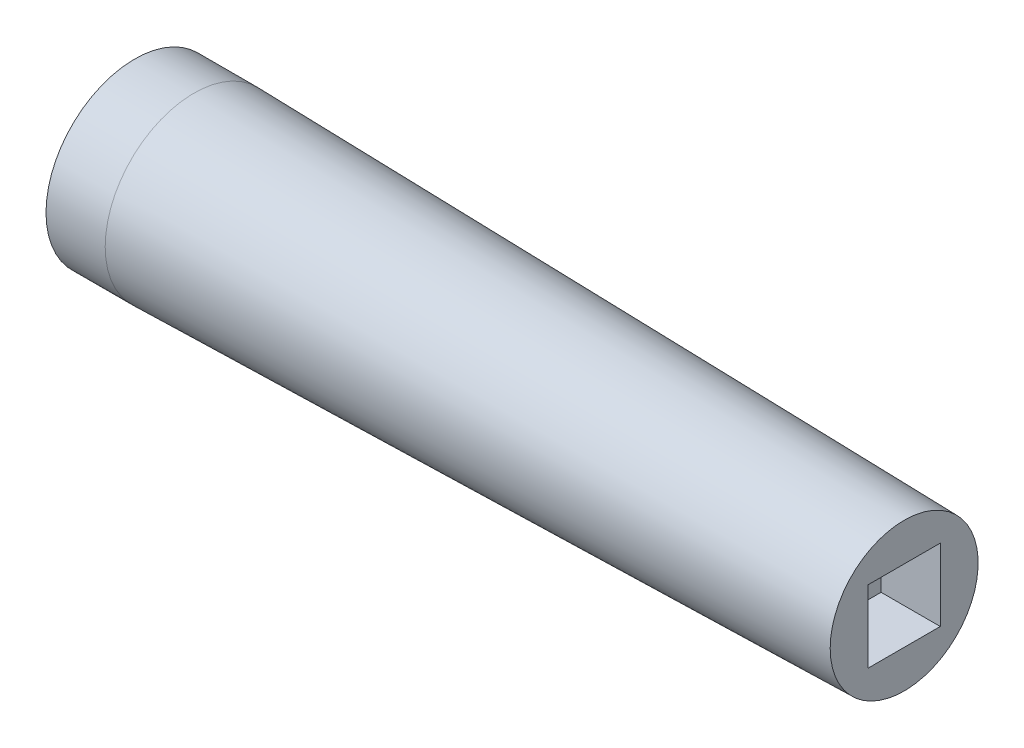
ISO-10303-21;
HEADER;
FILE_DESCRIPTION(('STEP AP214'),'2;1');
FILE_NAME('part.step','',(''),(''),'','','');
FILE_SCHEMA(('AUTOMOTIVE_DESIGN { 1 0 10303 214 1 1 1 1 }'));
ENDSEC;
DATA;
#1=APPLICATION_CONTEXT('core data for automotive mechanical design processes');
#2=APPLICATION_PROTOCOL_DEFINITION('international standard','automotive_design',2000,#1);
#3=PRODUCT_CONTEXT('',#1,'mechanical');
#4=PRODUCT('Part','Part','',(#3));
#5=PRODUCT_RELATED_PRODUCT_CATEGORY('part','',(#4));
#6=PRODUCT_DEFINITION_FORMATION('','',#4);
#7=PRODUCT_DEFINITION_CONTEXT('part definition',#1,'design');
#8=PRODUCT_DEFINITION('design','',#6,#7);
#9=PRODUCT_DEFINITION_SHAPE('','',#8);
#10=(LENGTH_UNIT() NAMED_UNIT(*) SI_UNIT(.MILLI.,.METRE.));
#11=(NAMED_UNIT(*) PLANE_ANGLE_UNIT() SI_UNIT($,.RADIAN.));
#12=(NAMED_UNIT(*) SI_UNIT($,.STERADIAN.) SOLID_ANGLE_UNIT());
#13=UNCERTAINTY_MEASURE_WITH_UNIT(LENGTH_MEASURE(1.E-05),#10,'distance_accuracy_value','');
#14=(GEOMETRIC_REPRESENTATION_CONTEXT(3) GLOBAL_UNCERTAINTY_ASSIGNED_CONTEXT((#13)) GLOBAL_UNIT_ASSIGNED_CONTEXT((#10,
#11,#12)) REPRESENTATION_CONTEXT('',''));
#15=CARTESIAN_POINT('',(0.,0.,0.));
#16=DIRECTION('',(0.,0.,1.));
#17=DIRECTION('',(1.,0.,0.));
#18=AXIS2_PLACEMENT_3D('',#15,#16,#17);
#19=CARTESIAN_POINT('',(0.,0.,0.));
#20=DIRECTION('',(1.,0.,0.));
#21=DIRECTION('',(0.,0.,-1.));
#22=AXIS2_PLACEMENT_3D('',#19,#20,#21);
#23=PLANE('',#22);
#24=CARTESIAN_POINT('',(0.,0.,0.));
#25=DIRECTION('',(-1.,0.,0.));
#26=DIRECTION('',(0.,0.,1.));
#27=AXIS2_PLACEMENT_3D('',#24,#25,#26);
#28=CIRCLE('',#27,19.05);
#29=CARTESIAN_POINT('',(0.,0.,19.05));
#30=VERTEX_POINT('',#29);
#31=EDGE_CURVE('E11',#30,#30,#28,.T.);
#32=ORIENTED_EDGE('',*,*,#31,.T.);
#33=EDGE_LOOP('',(#32));
#34=FACE_BOUND('',#33,.T.);
#35=ADVANCED_FACE('F34',(#34),#23,.F.);
#36=CARTESIAN_POINT('',(-5.7379004897005,0.,0.));
#37=DIRECTION('',(-1.,0.,0.));
#38=DIRECTION('',(0.,0.,1.));
#39=AXIS2_PLACEMENT_3D('',#36,#37,#38);
#40=CYLINDRICAL_SURFACE('',#39,19.05);
#41=ORIENTED_EDGE('',*,*,#31,.F.);
#42=EDGE_LOOP('',(#41));
#43=FACE_BOUND('',#42,.T.);
#44=CARTESIAN_POINT('',(12.7,0.,0.));
#45=DIRECTION('',(-1.,0.,0.));
#46=DIRECTION('',(0.,0.,1.));
#47=AXIS2_PLACEMENT_3D('',#44,#45,#46);
#48=CIRCLE('',#47,19.05);
#49=CARTESIAN_POINT('',(12.7,0.,19.05));
#50=VERTEX_POINT('',#49);
#51=EDGE_CURVE('E41',#50,#50,#48,.T.);
#52=ORIENTED_EDGE('',*,*,#51,.T.);
#53=EDGE_LOOP('',(#52));
#54=FACE_BOUND('',#53,.T.);
#55=ADVANCED_FACE('F116',(#43,#54),#40,.T.);
#56=CARTESIAN_POINT('',(165.1,0.,0.));
#57=DIRECTION('',(-1.,0.,0.));
#58=DIRECTION('',(0.,0.,1.));
#59=AXIS2_PLACEMENT_3D('',#56,#57,#58);
#60=CONICAL_SURFACE('',#59,15.875,0.0208303200362171);
#61=ORIENTED_EDGE('',*,*,#51,.F.);
#62=EDGE_LOOP('',(#61));
#63=FACE_BOUND('',#62,.T.);
#64=CARTESIAN_POINT('',(165.1,0.,0.));
#65=DIRECTION('',(-1.,0.,0.));
#66=DIRECTION('',(0.,0.,1.));
#67=AXIS2_PLACEMENT_3D('',#64,#65,#66);
#68=CIRCLE('',#67,15.875);
#69=CARTESIAN_POINT('',(165.1,0.,15.875));
#70=VERTEX_POINT('',#69);
#71=EDGE_CURVE('E109',#70,#70,#68,.T.);
#72=ORIENTED_EDGE('',*,*,#71,.T.);
#73=EDGE_LOOP('',(#72));
#74=FACE_BOUND('',#73,.T.);
#75=ADVANCED_FACE('F118',(#63,#74),#60,.T.);
#76=CARTESIAN_POINT('',(165.1,15.875,0.));
#77=DIRECTION('',(-1.,0.,0.));
#78=DIRECTION('',(0.,0.,1.));
#79=AXIS2_PLACEMENT_3D('',#76,#77,#78);
#80=PLANE('',#79);
#81=DIRECTION('',(0.,0.,-1.));
#82=VECTOR('',#81,1.);
#83=CARTESIAN_POINT('',(165.1,-7.747,-7.747));
#84=LINE('',#83,#82);
#85=CARTESIAN_POINT('',(165.1,-7.747,7.747));
#86=VERTEX_POINT('',#85);
#87=CARTESIAN_POINT('',(165.1,-7.747,-7.747));
#88=VERTEX_POINT('',#87);
#89=EDGE_CURVE('E83',#86,#88,#84,.T.);
#90=ORIENTED_EDGE('',*,*,#89,.F.);
#91=DIRECTION('',(0.,-1.,0.));
#92=VECTOR('',#91,1.);
#93=CARTESIAN_POINT('',(165.1,-7.747,7.747));
#94=LINE('',#93,#92);
#95=CARTESIAN_POINT('',(165.1,7.747,7.747));
#96=VERTEX_POINT('',#95);
#97=EDGE_CURVE('E48',#96,#86,#94,.T.);
#98=ORIENTED_EDGE('',*,*,#97,.F.);
#99=DIRECTION('',(0.,0.,1.));
#100=VECTOR('',#99,1.);
#101=CARTESIAN_POINT('',(165.1,7.747,-7.747));
#102=LINE('',#101,#100);
#103=CARTESIAN_POINT('',(165.1,7.747,-7.747));
#104=VERTEX_POINT('',#103);
#105=EDGE_CURVE('E99',#104,#96,#102,.T.);
#106=ORIENTED_EDGE('',*,*,#105,.F.);
#107=DIRECTION('',(0.,1.,0.));
#108=VECTOR('',#107,1.);
#109=CARTESIAN_POINT('',(165.1,-7.747,-7.747));
#110=LINE('',#109,#108);
#111=EDGE_CURVE('E105',#88,#104,#110,.T.);
#112=ORIENTED_EDGE('',*,*,#111,.F.);
#113=EDGE_LOOP('',(#90,#98,#106,#112));
#114=FACE_BOUND('',#113,.T.);
#115=ORIENTED_EDGE('',*,*,#71,.F.);
#116=EDGE_LOOP('',(#115));
#117=FACE_BOUND('',#116,.T.);
#118=ADVANCED_FACE('F121',(#114,#117),#80,.F.);
#119=CARTESIAN_POINT('',(152.4,-7.747,7.747));
#120=DIRECTION('',(0.,0.,1.));
#121=DIRECTION('',(1.,0.,0.));
#122=AXIS2_PLACEMENT_3D('',#119,#120,#121);
#123=PLANE('',#122);
#124=ORIENTED_EDGE('',*,*,#97,.T.);
#125=DIRECTION('',(1.,0.,0.));
#126=VECTOR('',#125,1.);
#127=CARTESIAN_POINT('',(152.4,-7.747,7.747));
#128=LINE('',#127,#126);
#129=CARTESIAN_POINT('',(152.4,-7.747,7.747));
#130=VERTEX_POINT('',#129);
#131=EDGE_CURVE('E71',#130,#86,#128,.T.);
#132=ORIENTED_EDGE('',*,*,#131,.F.);
#133=DIRECTION('',(0.,-1.,0.));
#134=VECTOR('',#133,1.);
#135=CARTESIAN_POINT('',(152.4,-7.747,7.747));
#136=LINE('',#135,#134);
#137=CARTESIAN_POINT('',(152.4,7.747,7.747));
#138=VERTEX_POINT('',#137);
#139=EDGE_CURVE('E97',#138,#130,#136,.T.);
#140=ORIENTED_EDGE('',*,*,#139,.F.);
#141=DIRECTION('',(1.,0.,0.));
#142=VECTOR('',#141,1.);
#143=CARTESIAN_POINT('',(152.4,7.747,7.747));
#144=LINE('',#143,#142);
#145=EDGE_CURVE('E56',#138,#96,#144,.T.);
#146=ORIENTED_EDGE('',*,*,#145,.T.);
#147=EDGE_LOOP('',(#124,#132,#140,#146));
#148=FACE_BOUND('',#147,.T.);
#149=ADVANCED_FACE('F126',(#148),#123,.F.);
#150=CARTESIAN_POINT('',(152.4,7.747,-7.747));
#151=DIRECTION('',(0.,1.,0.));
#152=DIRECTION('',(0.,0.,1.));
#153=AXIS2_PLACEMENT_3D('',#150,#151,#152);
#154=PLANE('',#153);
#155=ORIENTED_EDGE('',*,*,#105,.T.);
#156=ORIENTED_EDGE('',*,*,#145,.F.);
#157=DIRECTION('',(0.,0.,1.));
#158=VECTOR('',#157,1.);
#159=CARTESIAN_POINT('',(152.4,7.747,-7.747));
#160=LINE('',#159,#158);
#161=CARTESIAN_POINT('',(152.4,7.747,-7.747));
#162=VERTEX_POINT('',#161);
#163=EDGE_CURVE('E94',#162,#138,#160,.T.);
#164=ORIENTED_EDGE('',*,*,#163,.F.);
#165=DIRECTION('',(1.,0.,0.));
#166=VECTOR('',#165,1.);
#167=CARTESIAN_POINT('',(152.4,7.747,-7.747));
#168=LINE('',#167,#166);
#169=EDGE_CURVE('E87',#162,#104,#168,.T.);
#170=ORIENTED_EDGE('',*,*,#169,.T.);
#171=EDGE_LOOP('',(#155,#156,#164,#170));
#172=FACE_BOUND('',#171,.T.);
#173=ADVANCED_FACE('F132',(#172),#154,.F.);
#174=CARTESIAN_POINT('',(152.4,-7.747,-7.747));
#175=DIRECTION('',(0.,0.,-1.));
#176=DIRECTION('',(-1.,0.,0.));
#177=AXIS2_PLACEMENT_3D('',#174,#175,#176);
#178=PLANE('',#177);
#179=ORIENTED_EDGE('',*,*,#111,.T.);
#180=ORIENTED_EDGE('',*,*,#169,.F.);
#181=DIRECTION('',(0.,1.,0.));
#182=VECTOR('',#181,1.);
#183=CARTESIAN_POINT('',(152.4,-7.747,-7.747));
#184=LINE('',#183,#182);
#185=CARTESIAN_POINT('',(152.4,-7.747,-7.747));
#186=VERTEX_POINT('',#185);
#187=EDGE_CURVE('E90',#186,#162,#184,.T.);
#188=ORIENTED_EDGE('',*,*,#187,.F.);
#189=DIRECTION('',(1.,0.,0.));
#190=VECTOR('',#189,1.);
#191=CARTESIAN_POINT('',(152.4,-7.747,-7.747));
#192=LINE('',#191,#190);
#193=EDGE_CURVE('E76',#186,#88,#192,.T.);
#194=ORIENTED_EDGE('',*,*,#193,.T.);
#195=EDGE_LOOP('',(#179,#180,#188,#194));
#196=FACE_BOUND('',#195,.T.);
#197=ADVANCED_FACE('F91',(#196),#178,.F.);
#198=CARTESIAN_POINT('',(152.4,-7.747,-7.747));
#199=DIRECTION('',(0.,-1.,0.));
#200=DIRECTION('',(0.,0.,-1.));
#201=AXIS2_PLACEMENT_3D('',#198,#199,#200);
#202=PLANE('',#201);
#203=ORIENTED_EDGE('',*,*,#89,.T.);
#204=ORIENTED_EDGE('',*,*,#193,.F.);
#205=DIRECTION('',(0.,0.,-1.));
#206=VECTOR('',#205,1.);
#207=CARTESIAN_POINT('',(152.4,-7.747,-7.747));
#208=LINE('',#207,#206);
#209=EDGE_CURVE('E80',#130,#186,#208,.T.);
#210=ORIENTED_EDGE('',*,*,#209,.F.);
#211=ORIENTED_EDGE('',*,*,#131,.T.);
#212=EDGE_LOOP('',(#203,#204,#210,#211));
#213=FACE_BOUND('',#212,.T.);
#214=ADVANCED_FACE('F78',(#213),#202,.F.);
#215=CARTESIAN_POINT('',(152.4,0.,0.));
#216=DIRECTION('',(1.,0.,0.));
#217=DIRECTION('',(0.,0.,-1.));
#218=AXIS2_PLACEMENT_3D('',#215,#216,#217);
#219=PLANE('',#218);
#220=ORIENTED_EDGE('',*,*,#139,.T.);
#221=ORIENTED_EDGE('',*,*,#209,.T.);
#222=ORIENTED_EDGE('',*,*,#187,.T.);
#223=ORIENTED_EDGE('',*,*,#163,.T.);
#224=EDGE_LOOP('',(#220,#221,#222,#223));
#225=FACE_BOUND('',#224,.T.);
#226=ADVANCED_FACE('F96',(#225),#219,.T.);
#227=CLOSED_SHELL('',(#35,#55,#75,#118,#149,#173,#197,#214,#226));
#228=MANIFOLD_SOLID_BREP('B2',#227);
#229=ADVANCED_BREP_SHAPE_REPRESENTATION('',(#18,#228),#14);
#230=SHAPE_DEFINITION_REPRESENTATION(#9,#229);
ENDSEC;
END-ISO-10303-21;
